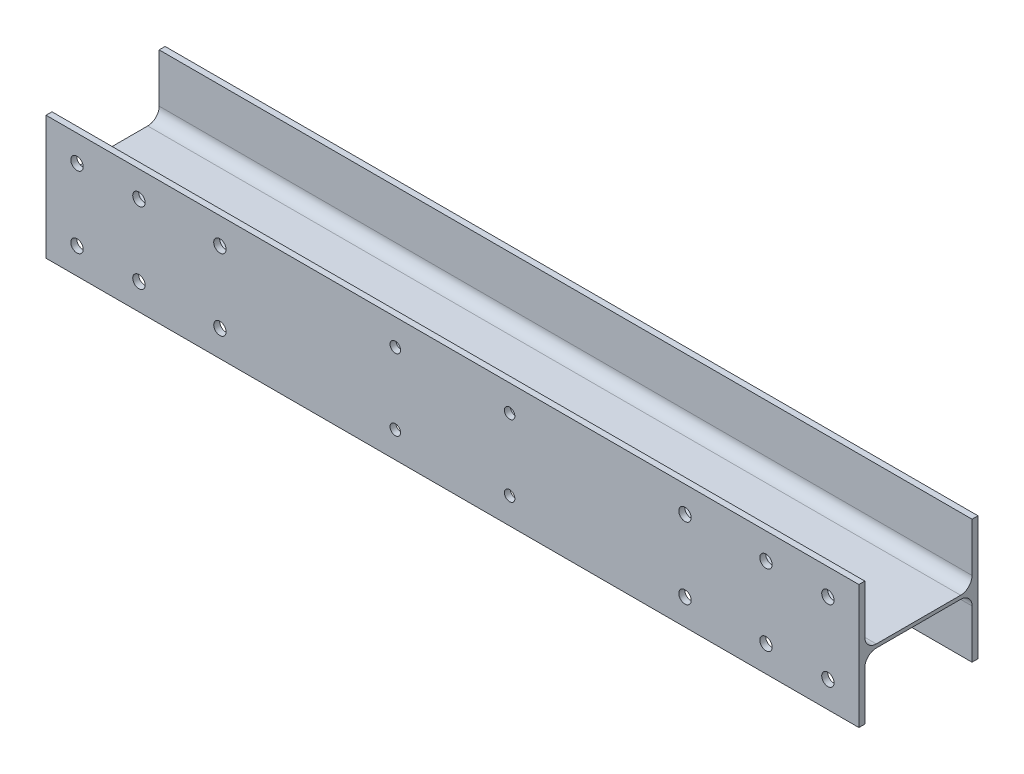
ISO-10303-21;
HEADER;
FILE_DESCRIPTION(('STEP AP214'),'2;1');
FILE_NAME('part.step','',(''),(''),'','','');
FILE_SCHEMA(('AUTOMOTIVE_DESIGN { 1 0 10303 214 1 1 1 1 }'));
ENDSEC;
DATA;
#1=APPLICATION_CONTEXT('core data for automotive mechanical design processes');
#2=APPLICATION_PROTOCOL_DEFINITION('international standard','automotive_design',2000,#1);
#3=PRODUCT_CONTEXT('',#1,'mechanical');
#4=PRODUCT('Part','Part','',(#3));
#5=PRODUCT_RELATED_PRODUCT_CATEGORY('part','',(#4));
#6=PRODUCT_DEFINITION_FORMATION('','',#4);
#7=PRODUCT_DEFINITION_CONTEXT('part definition',#1,'design');
#8=PRODUCT_DEFINITION('design','',#6,#7);
#9=PRODUCT_DEFINITION_SHAPE('','',#8);
#10=(LENGTH_UNIT() NAMED_UNIT(*) SI_UNIT(.MILLI.,.METRE.));
#11=(NAMED_UNIT(*) PLANE_ANGLE_UNIT() SI_UNIT($,.RADIAN.));
#12=(NAMED_UNIT(*) SI_UNIT($,.STERADIAN.) SOLID_ANGLE_UNIT());
#13=UNCERTAINTY_MEASURE_WITH_UNIT(LENGTH_MEASURE(1.E-05),#10,'distance_accuracy_value','');
#14=(GEOMETRIC_REPRESENTATION_CONTEXT(3) GLOBAL_UNCERTAINTY_ASSIGNED_CONTEXT((#13)) GLOBAL_UNIT_ASSIGNED_CONTEXT((#10,
#11,#12)) REPRESENTATION_CONTEXT('',''));
#15=CARTESIAN_POINT('',(0.,0.,0.));
#16=DIRECTION('',(0.,0.,1.));
#17=DIRECTION('',(1.,0.,0.));
#18=AXIS2_PLACEMENT_3D('',#15,#16,#17);
#19=CARTESIAN_POINT('',(-853.,27.7499999999998,88.5));
#20=DIRECTION('',(1.,0.,0.));
#21=DIRECTION('',(0.,1.,0.));
#22=AXIS2_PLACEMENT_3D('',#19,#20,#21);
#23=CYLINDRICAL_SURFACE('',#22,24.);
#24=CARTESIAN_POINT('',(853.,27.7500000000003,88.5));
#25=DIRECTION('',(1.,0.,0.));
#26=DIRECTION('',(0.,-1.,0.));
#27=AXIS2_PLACEMENT_3D('',#24,#25,#26);
#28=CIRCLE('',#27,24.);
#29=CARTESIAN_POINT('',(853.,27.7500000000003,112.5));
#30=VERTEX_POINT('',#29);
#31=CARTESIAN_POINT('',(853.,3.7500000000003,88.5));
#32=VERTEX_POINT('',#31);
#33=EDGE_CURVE('E232',#30,#32,#28,.T.);
#34=ORIENTED_EDGE('',*,*,#33,.T.);
#35=DIRECTION('',(1.,0.,0.));
#36=VECTOR('',#35,1.);
#37=CARTESIAN_POINT('',(-853.,3.74999999999978,88.5));
#38=LINE('',#37,#36);
#39=CARTESIAN_POINT('',(-853.,3.74999999999978,88.5));
#40=VERTEX_POINT('',#39);
#41=EDGE_CURVE('E13',#40,#32,#38,.T.);
#42=ORIENTED_EDGE('',*,*,#41,.F.);
#43=CARTESIAN_POINT('',(-853.,27.7499999999998,88.5));
#44=DIRECTION('',(1.,0.,0.));
#45=DIRECTION('',(0.,-1.,0.));
#46=AXIS2_PLACEMENT_3D('',#43,#44,#45);
#47=CIRCLE('',#46,24.);
#48=CARTESIAN_POINT('',(-853.,27.7499999999998,112.5));
#49=VERTEX_POINT('',#48);
#50=EDGE_CURVE('E263',#49,#40,#47,.T.);
#51=ORIENTED_EDGE('',*,*,#50,.F.);
#52=DIRECTION('',(1.,0.,0.));
#53=VECTOR('',#52,1.);
#54=CARTESIAN_POINT('',(-853.,27.7499999999998,112.5));
#55=LINE('',#54,#53);
#56=EDGE_CURVE('E228',#49,#30,#55,.T.);
#57=ORIENTED_EDGE('',*,*,#56,.T.);
#58=EDGE_LOOP('',(#34,#42,#51,#57));
#59=FACE_BOUND('',#58,.T.);
#60=ADVANCED_FACE('F88',(#59),#23,.F.);
#61=CARTESIAN_POINT('',(-853.,3.7499999999998,-88.5));
#62=DIRECTION('',(0.,-1.,0.));
#63=DIRECTION('',(1.,0.,0.));
#64=AXIS2_PLACEMENT_3D('',#61,#62,#63);
#65=PLANE('',#64);
#66=DIRECTION('',(0.,0.,-1.));
#67=VECTOR('',#66,1.);
#68=CARTESIAN_POINT('',(853.,3.75000000000032,-88.5));
#69=LINE('',#68,#67);
#70=CARTESIAN_POINT('',(853.,3.75000000000032,-88.5));
#71=VERTEX_POINT('',#70);
#72=EDGE_CURVE('E235',#32,#71,#69,.T.);
#73=ORIENTED_EDGE('',*,*,#72,.T.);
#74=DIRECTION('',(1.,0.,0.));
#75=VECTOR('',#74,1.);
#76=CARTESIAN_POINT('',(-853.,3.7499999999998,-88.5));
#77=LINE('',#76,#75);
#78=CARTESIAN_POINT('',(-853.,3.7499999999998,-88.5));
#79=VERTEX_POINT('',#78);
#80=EDGE_CURVE('E96',#79,#71,#77,.T.);
#81=ORIENTED_EDGE('',*,*,#80,.F.);
#82=DIRECTION('',(0.,0.,-1.));
#83=VECTOR('',#82,1.);
#84=CARTESIAN_POINT('',(-853.,3.7499999999998,-88.5));
#85=LINE('',#84,#83);
#86=EDGE_CURVE('E171',#40,#79,#85,.T.);
#87=ORIENTED_EDGE('',*,*,#86,.F.);
#88=ORIENTED_EDGE('',*,*,#41,.T.);
#89=EDGE_LOOP('',(#73,#81,#87,#88));
#90=FACE_BOUND('',#89,.T.);
#91=ADVANCED_FACE('F364',(#90),#65,.F.);
#92=CARTESIAN_POINT('',(-853.,27.7499999999998,-88.5));
#93=DIRECTION('',(1.,0.,0.));
#94=DIRECTION('',(0.,1.,0.));
#95=AXIS2_PLACEMENT_3D('',#92,#93,#94);
#96=CYLINDRICAL_SURFACE('',#95,24.);
#97=CARTESIAN_POINT('',(853.,27.7500000000003,-88.5));
#98=DIRECTION('',(1.,0.,0.));
#99=DIRECTION('',(0.,-1.,0.));
#100=AXIS2_PLACEMENT_3D('',#97,#98,#99);
#101=CIRCLE('',#100,24.);
#102=CARTESIAN_POINT('',(853.,27.7500000000003,-112.5));
#103=VERTEX_POINT('',#102);
#104=EDGE_CURVE('E238',#71,#103,#101,.T.);
#105=ORIENTED_EDGE('',*,*,#104,.T.);
#106=DIRECTION('',(1.,0.,0.));
#107=VECTOR('',#106,1.);
#108=CARTESIAN_POINT('',(-853.,27.7499999999998,-112.5));
#109=LINE('',#108,#107);
#110=CARTESIAN_POINT('',(-853.,27.7499999999998,-112.5));
#111=VERTEX_POINT('',#110);
#112=EDGE_CURVE('E294',#111,#103,#109,.T.);
#113=ORIENTED_EDGE('',*,*,#112,.F.);
#114=CARTESIAN_POINT('',(-853.,27.7499999999998,-88.5));
#115=DIRECTION('',(1.,0.,0.));
#116=DIRECTION('',(0.,-1.,0.));
#117=AXIS2_PLACEMENT_3D('',#114,#115,#116);
#118=CIRCLE('',#117,24.);
#119=EDGE_CURVE('E302',#79,#111,#118,.T.);
#120=ORIENTED_EDGE('',*,*,#119,.F.);
#121=ORIENTED_EDGE('',*,*,#80,.T.);
#122=EDGE_LOOP('',(#105,#113,#120,#121));
#123=FACE_BOUND('',#122,.T.);
#124=ADVANCED_FACE('F300',(#123),#96,.F.);
#125=CARTESIAN_POINT('',(-853.,27.7499999999998,-112.5));
#126=DIRECTION('',(0.,0.,-1.));
#127=DIRECTION('',(-1.,0.,0.));
#128=AXIS2_PLACEMENT_3D('',#125,#126,#127);
#129=PLANE('',#128);
#130=DIRECTION('',(0.,1.,0.));
#131=VECTOR('',#130,1.);
#132=CARTESIAN_POINT('',(853.,27.7500000000003,-112.5));
#133=LINE('',#132,#131);
#134=CARTESIAN_POINT('',(853.,130.,-112.5));
#135=VERTEX_POINT('',#134);
#136=EDGE_CURVE('E240',#103,#135,#133,.T.);
#137=ORIENTED_EDGE('',*,*,#136,.T.);
#138=DIRECTION('',(1.,0.,0.));
#139=VECTOR('',#138,1.);
#140=CARTESIAN_POINT('',(-853.,130.,-112.5));
#141=LINE('',#140,#139);
#142=CARTESIAN_POINT('',(-853.,130.,-112.5));
#143=VERTEX_POINT('',#142);
#144=EDGE_CURVE('E291',#143,#135,#141,.T.);
#145=ORIENTED_EDGE('',*,*,#144,.F.);
#146=DIRECTION('',(0.,1.,0.));
#147=VECTOR('',#146,1.);
#148=CARTESIAN_POINT('',(-853.,27.7499999999998,-112.5));
#149=LINE('',#148,#147);
#150=EDGE_CURVE('E320',#111,#143,#149,.T.);
#151=ORIENTED_EDGE('',*,*,#150,.F.);
#152=ORIENTED_EDGE('',*,*,#112,.T.);
#153=EDGE_LOOP('',(#137,#145,#151,#152));
#154=FACE_BOUND('',#153,.T.);
#155=ADVANCED_FACE('F311',(#154),#129,.F.);
#156=CARTESIAN_POINT('',(-853.,130.,-112.5));
#157=DIRECTION('',(0.,-1.,0.));
#158=DIRECTION('',(1.,0.,0.));
#159=AXIS2_PLACEMENT_3D('',#156,#157,#158);
#160=PLANE('',#159);
#161=DIRECTION('',(0.,0.,-1.));
#162=VECTOR('',#161,1.);
#163=CARTESIAN_POINT('',(853.,130.,-112.5));
#164=LINE('',#163,#162);
#165=CARTESIAN_POINT('',(853.,130.,-125.));
#166=VERTEX_POINT('',#165);
#167=EDGE_CURVE('E242',#135,#166,#164,.T.);
#168=ORIENTED_EDGE('',*,*,#167,.T.);
#169=DIRECTION('',(1.,0.,0.));
#170=VECTOR('',#169,1.);
#171=CARTESIAN_POINT('',(-853.,130.,-125.));
#172=LINE('',#171,#170);
#173=CARTESIAN_POINT('',(-853.,130.,-125.));
#174=VERTEX_POINT('',#173);
#175=EDGE_CURVE('E288',#174,#166,#172,.T.);
#176=ORIENTED_EDGE('',*,*,#175,.F.);
#177=DIRECTION('',(0.,0.,-1.));
#178=VECTOR('',#177,1.);
#179=CARTESIAN_POINT('',(-853.,130.,-112.5));
#180=LINE('',#179,#178);
#181=EDGE_CURVE('E317',#143,#174,#180,.T.);
#182=ORIENTED_EDGE('',*,*,#181,.F.);
#183=ORIENTED_EDGE('',*,*,#144,.T.);
#184=EDGE_LOOP('',(#168,#176,#182,#183));
#185=FACE_BOUND('',#184,.T.);
#186=ADVANCED_FACE('F315',(#185),#160,.F.);
#187=CARTESIAN_POINT('',(-853.,130.,-125.));
#188=DIRECTION('',(0.,0.,1.));
#189=DIRECTION('',(1.,0.,0.));
#190=AXIS2_PLACEMENT_3D('',#187,#188,#189);
#191=PLANE('',#190);
#192=DIRECTION('',(0.,-1.,0.));
#193=VECTOR('',#192,1.);
#194=CARTESIAN_POINT('',(853.,130.,-125.));
#195=LINE('',#194,#193);
#196=CARTESIAN_POINT('',(853.,-130.,-125.));
#197=VERTEX_POINT('',#196);
#198=EDGE_CURVE('E244',#166,#197,#195,.T.);
#199=ORIENTED_EDGE('',*,*,#198,.T.);
#200=DIRECTION('',(1.,0.,0.));
#201=VECTOR('',#200,1.);
#202=CARTESIAN_POINT('',(-853.,-130.,-125.));
#203=LINE('',#202,#201);
#204=CARTESIAN_POINT('',(-853.,-130.,-125.));
#205=VERTEX_POINT('',#204);
#206=EDGE_CURVE('E285',#205,#197,#203,.T.);
#207=ORIENTED_EDGE('',*,*,#206,.F.);
#208=DIRECTION('',(0.,-1.,0.));
#209=VECTOR('',#208,1.);
#210=CARTESIAN_POINT('',(-853.,130.,-125.));
#211=LINE('',#210,#209);
#212=EDGE_CURVE('E319',#174,#205,#211,.T.);
#213=ORIENTED_EDGE('',*,*,#212,.F.);
#214=ORIENTED_EDGE('',*,*,#175,.T.);
#215=EDGE_LOOP('',(#199,#207,#213,#214));
#216=FACE_BOUND('',#215,.T.);
#217=ADVANCED_FACE('F377',(#216),#191,.F.);
#218=CARTESIAN_POINT('',(-853.,-130.,-125.));
#219=DIRECTION('',(0.,1.,0.));
#220=DIRECTION('',(-1.,0.,0.));
#221=AXIS2_PLACEMENT_3D('',#218,#219,#220);
#222=PLANE('',#221);
#223=DIRECTION('',(0.,0.,1.));
#224=VECTOR('',#223,1.);
#225=CARTESIAN_POINT('',(853.,-130.,-125.));
#226=LINE('',#225,#224);
#227=CARTESIAN_POINT('',(853.,-130.,-112.5));
#228=VERTEX_POINT('',#227);
#229=EDGE_CURVE('E246',#197,#228,#226,.T.);
#230=ORIENTED_EDGE('',*,*,#229,.T.);
#231=DIRECTION('',(1.,0.,0.));
#232=VECTOR('',#231,1.);
#233=CARTESIAN_POINT('',(-853.,-130.,-112.5));
#234=LINE('',#233,#232);
#235=CARTESIAN_POINT('',(-853.,-130.,-112.5));
#236=VERTEX_POINT('',#235);
#237=EDGE_CURVE('E282',#236,#228,#234,.T.);
#238=ORIENTED_EDGE('',*,*,#237,.F.);
#239=DIRECTION('',(0.,0.,1.));
#240=VECTOR('',#239,1.);
#241=CARTESIAN_POINT('',(-853.,-130.,-125.));
#242=LINE('',#241,#240);
#243=EDGE_CURVE('E322',#205,#236,#242,.T.);
#244=ORIENTED_EDGE('',*,*,#243,.F.);
#245=ORIENTED_EDGE('',*,*,#206,.T.);
#246=EDGE_LOOP('',(#230,#238,#244,#245));
#247=FACE_BOUND('',#246,.T.);
#248=ADVANCED_FACE('F380',(#247),#222,.F.);
#249=CARTESIAN_POINT('',(-853.,-130.,-112.5));
#250=DIRECTION('',(0.,0.,-1.));
#251=DIRECTION('',(0.,1.,0.));
#252=AXIS2_PLACEMENT_3D('',#249,#250,#251);
#253=PLANE('',#252);
#254=DIRECTION('',(0.,1.,0.));
#255=VECTOR('',#254,1.);
#256=CARTESIAN_POINT('',(853.,-130.,-112.5));
#257=LINE('',#256,#255);
#258=CARTESIAN_POINT('',(853.,-27.7499999999997,-112.5));
#259=VERTEX_POINT('',#258);
#260=EDGE_CURVE('E248',#228,#259,#257,.T.);
#261=ORIENTED_EDGE('',*,*,#260,.T.);
#262=DIRECTION('',(1.,0.,0.));
#263=VECTOR('',#262,1.);
#264=CARTESIAN_POINT('',(-853.,-27.7500000000002,-112.5));
#265=LINE('',#264,#263);
#266=CARTESIAN_POINT('',(-853.,-27.7500000000002,-112.5));
#267=VERTEX_POINT('',#266);
#268=EDGE_CURVE('E279',#267,#259,#265,.T.);
#269=ORIENTED_EDGE('',*,*,#268,.F.);
#270=DIRECTION('',(0.,1.,0.));
#271=VECTOR('',#270,1.);
#272=CARTESIAN_POINT('',(-853.,-130.,-112.5));
#273=LINE('',#272,#271);
#274=EDGE_CURVE('E328',#236,#267,#273,.T.);
#275=ORIENTED_EDGE('',*,*,#274,.F.);
#276=ORIENTED_EDGE('',*,*,#237,.T.);
#277=EDGE_LOOP('',(#261,#269,#275,#276));
#278=FACE_BOUND('',#277,.T.);
#279=ADVANCED_FACE('F384',(#278),#253,.F.);
#280=CARTESIAN_POINT('',(-853.,-27.7500000000002,-88.5));
#281=DIRECTION('',(1.,0.,0.));
#282=DIRECTION('',(0.,1.,0.));
#283=AXIS2_PLACEMENT_3D('',#280,#281,#282);
#284=CYLINDRICAL_SURFACE('',#283,24.);
#285=CARTESIAN_POINT('',(853.,-27.7499999999997,-88.5));
#286=DIRECTION('',(1.,0.,0.));
#287=DIRECTION('',(0.,-1.,0.));
#288=AXIS2_PLACEMENT_3D('',#285,#286,#287);
#289=CIRCLE('',#288,24.);
#290=CARTESIAN_POINT('',(853.,-3.74999999999969,-88.5));
#291=VERTEX_POINT('',#290);
#292=EDGE_CURVE('E250',#259,#291,#289,.T.);
#293=ORIENTED_EDGE('',*,*,#292,.T.);
#294=DIRECTION('',(1.,0.,0.));
#295=VECTOR('',#294,1.);
#296=CARTESIAN_POINT('',(-853.,-3.75000000000021,-88.5));
#297=LINE('',#296,#295);
#298=CARTESIAN_POINT('',(-853.,-3.75000000000021,-88.5));
#299=VERTEX_POINT('',#298);
#300=EDGE_CURVE('E276',#299,#291,#297,.T.);
#301=ORIENTED_EDGE('',*,*,#300,.F.);
#302=CARTESIAN_POINT('',(-853.,-27.7500000000002,-88.5));
#303=DIRECTION('',(1.,0.,0.));
#304=DIRECTION('',(0.,-1.,0.));
#305=AXIS2_PLACEMENT_3D('',#302,#303,#304);
#306=CIRCLE('',#305,24.);
#307=EDGE_CURVE('E330',#267,#299,#306,.T.);
#308=ORIENTED_EDGE('',*,*,#307,.F.);
#309=ORIENTED_EDGE('',*,*,#268,.T.);
#310=EDGE_LOOP('',(#293,#301,#308,#309));
#311=FACE_BOUND('',#310,.T.);
#312=ADVANCED_FACE('F388',(#311),#284,.F.);
#313=CARTESIAN_POINT('',(-853.,-3.75000000000021,-88.5));
#314=DIRECTION('',(0.,1.,0.));
#315=DIRECTION('',(-1.,0.,0.));
#316=AXIS2_PLACEMENT_3D('',#313,#314,#315);
#317=PLANE('',#316);
#318=DIRECTION('',(0.,0.,1.));
#319=VECTOR('',#318,1.);
#320=CARTESIAN_POINT('',(853.,-3.74999999999969,-88.5));
#321=LINE('',#320,#319);
#322=CARTESIAN_POINT('',(853.,-3.74999999999967,88.5));
#323=VERTEX_POINT('',#322);
#324=EDGE_CURVE('E252',#291,#323,#321,.T.);
#325=ORIENTED_EDGE('',*,*,#324,.T.);
#326=DIRECTION('',(1.,0.,0.));
#327=VECTOR('',#326,1.);
#328=CARTESIAN_POINT('',(-853.,-3.75000000000019,88.5));
#329=LINE('',#328,#327);
#330=CARTESIAN_POINT('',(-853.,-3.75000000000019,88.5));
#331=VERTEX_POINT('',#330);
#332=EDGE_CURVE('E273',#331,#323,#329,.T.);
#333=ORIENTED_EDGE('',*,*,#332,.F.);
#334=DIRECTION('',(0.,0.,1.));
#335=VECTOR('',#334,1.);
#336=CARTESIAN_POINT('',(-853.,-3.75000000000021,-88.5));
#337=LINE('',#336,#335);
#338=EDGE_CURVE('E332',#299,#331,#337,.T.);
#339=ORIENTED_EDGE('',*,*,#338,.F.);
#340=ORIENTED_EDGE('',*,*,#300,.T.);
#341=EDGE_LOOP('',(#325,#333,#339,#340));
#342=FACE_BOUND('',#341,.T.);
#343=ADVANCED_FACE('F392',(#342),#317,.F.);
#344=CARTESIAN_POINT('',(-853.,-27.7500000000002,88.5));
#345=DIRECTION('',(1.,0.,0.));
#346=DIRECTION('',(0.,1.,0.));
#347=AXIS2_PLACEMENT_3D('',#344,#345,#346);
#348=CYLINDRICAL_SURFACE('',#347,24.);
#349=CARTESIAN_POINT('',(853.,-27.7499999999997,88.5));
#350=DIRECTION('',(1.,0.,0.));
#351=DIRECTION('',(0.,-1.,0.));
#352=AXIS2_PLACEMENT_3D('',#349,#350,#351);
#353=CIRCLE('',#352,24.);
#354=CARTESIAN_POINT('',(853.,-27.7499999999997,112.5));
#355=VERTEX_POINT('',#354);
#356=EDGE_CURVE('E254',#323,#355,#353,.T.);
#357=ORIENTED_EDGE('',*,*,#356,.T.);
#358=DIRECTION('',(1.,0.,0.));
#359=VECTOR('',#358,1.);
#360=CARTESIAN_POINT('',(-853.,-27.7500000000002,112.5));
#361=LINE('',#360,#359);
#362=CARTESIAN_POINT('',(-853.,-27.7500000000002,112.5));
#363=VERTEX_POINT('',#362);
#364=EDGE_CURVE('E270',#363,#355,#361,.T.);
#365=ORIENTED_EDGE('',*,*,#364,.F.);
#366=CARTESIAN_POINT('',(-853.,-27.7500000000002,88.5));
#367=DIRECTION('',(1.,0.,0.));
#368=DIRECTION('',(0.,-1.,0.));
#369=AXIS2_PLACEMENT_3D('',#366,#367,#368);
#370=CIRCLE('',#369,24.);
#371=EDGE_CURVE('E334',#331,#363,#370,.T.);
#372=ORIENTED_EDGE('',*,*,#371,.F.);
#373=ORIENTED_EDGE('',*,*,#332,.T.);
#374=EDGE_LOOP('',(#357,#365,#372,#373));
#375=FACE_BOUND('',#374,.T.);
#376=ADVANCED_FACE('F396',(#375),#348,.F.);
#377=CARTESIAN_POINT('',(-853.,-27.7500000000002,112.5));
#378=DIRECTION('',(0.,0.,1.));
#379=DIRECTION('',(0.,-1.,0.));
#380=AXIS2_PLACEMENT_3D('',#377,#378,#379);
#381=PLANE('',#380);
#382=CARTESIAN_POINT('',(120.,-75.,112.5));
#383=DIRECTION('',(0.,0.,1.));
#384=DIRECTION('',(0.,-1.,0.));
#385=AXIS2_PLACEMENT_3D('',#382,#383,#384);
#386=CIRCLE('',#385,11.);
#387=CARTESIAN_POINT('',(120.,-86.,112.5));
#388=VERTEX_POINT('',#387);
#389=EDGE_CURVE('E536',#388,#388,#386,.F.);
#390=ORIENTED_EDGE('',*,*,#389,.F.);
#391=EDGE_LOOP('',(#390));
#392=FACE_BOUND('',#391,.T.);
#393=CARTESIAN_POINT('',(-120.,-75.,112.5));
#394=DIRECTION('',(0.,0.,1.));
#395=DIRECTION('',(0.,-1.,0.));
#396=AXIS2_PLACEMENT_3D('',#393,#394,#395);
#397=CIRCLE('',#396,11.);
#398=CARTESIAN_POINT('',(-120.,-86.,112.5));
#399=VERTEX_POINT('',#398);
#400=EDGE_CURVE('E532',#399,#399,#397,.F.);
#401=ORIENTED_EDGE('',*,*,#400,.F.);
#402=EDGE_LOOP('',(#401));
#403=FACE_BOUND('',#402,.T.);
#404=CARTESIAN_POINT('',(788.,-74.9999999999999,112.5));
#405=DIRECTION('',(0.,0.,1.));
#406=DIRECTION('',(0.,-1.,0.));
#407=AXIS2_PLACEMENT_3D('',#404,#405,#406);
#408=CIRCLE('',#407,13.);
#409=CARTESIAN_POINT('',(788.,-87.9999999999999,112.5));
#410=VERTEX_POINT('',#409);
#411=EDGE_CURVE('E516',#410,#410,#408,.F.);
#412=ORIENTED_EDGE('',*,*,#411,.F.);
#413=EDGE_LOOP('',(#412));
#414=FACE_BOUND('',#413,.T.);
#415=CARTESIAN_POINT('',(658.,-74.9999999999999,112.5));
#416=DIRECTION('',(0.,0.,1.));
#417=DIRECTION('',(0.,-1.,0.));
#418=AXIS2_PLACEMENT_3D('',#415,#416,#417);
#419=CIRCLE('',#418,13.);
#420=CARTESIAN_POINT('',(658.,-87.9999999999999,112.5));
#421=VERTEX_POINT('',#420);
#422=EDGE_CURVE('E512',#421,#421,#419,.F.);
#423=ORIENTED_EDGE('',*,*,#422,.F.);
#424=EDGE_LOOP('',(#423));
#425=FACE_BOUND('',#424,.T.);
#426=CARTESIAN_POINT('',(488.,-74.9999999999999,112.5));
#427=DIRECTION('',(0.,0.,1.));
#428=DIRECTION('',(0.,-1.,0.));
#429=AXIS2_PLACEMENT_3D('',#426,#427,#428);
#430=CIRCLE('',#429,13.0000000000001);
#431=CARTESIAN_POINT('',(488.,-88.,112.5));
#432=VERTEX_POINT('',#431);
#433=EDGE_CURVE('E500',#432,#432,#430,.F.);
#434=ORIENTED_EDGE('',*,*,#433,.F.);
#435=EDGE_LOOP('',(#434));
#436=FACE_BOUND('',#435,.T.);
#437=CARTESIAN_POINT('',(-488.,-75.,112.5));
#438=DIRECTION('',(0.,0.,1.));
#439=DIRECTION('',(0.,-1.,0.));
#440=AXIS2_PLACEMENT_3D('',#437,#438,#439);
#441=CIRCLE('',#440,13.);
#442=CARTESIAN_POINT('',(-488.,-88.,112.5));
#443=VERTEX_POINT('',#442);
#444=EDGE_CURVE('E496',#443,#443,#441,.F.);
#445=ORIENTED_EDGE('',*,*,#444,.F.);
#446=EDGE_LOOP('',(#445));
#447=FACE_BOUND('',#446,.T.);
#448=CARTESIAN_POINT('',(-658.,-75.0000000000001,112.5));
#449=DIRECTION('',(0.,0.,1.));
#450=DIRECTION('',(0.,-1.,0.));
#451=AXIS2_PLACEMENT_3D('',#448,#449,#450);
#452=CIRCLE('',#451,13.);
#453=CARTESIAN_POINT('',(-658.,-88.0000000000001,112.5));
#454=VERTEX_POINT('',#453);
#455=EDGE_CURVE('E484',#454,#454,#452,.F.);
#456=ORIENTED_EDGE('',*,*,#455,.F.);
#457=EDGE_LOOP('',(#456));
#458=FACE_BOUND('',#457,.T.);
#459=CARTESIAN_POINT('',(-788.,-75.0000000000001,112.5));
#460=DIRECTION('',(0.,0.,1.));
#461=DIRECTION('',(0.,-1.,0.));
#462=AXIS2_PLACEMENT_3D('',#459,#460,#461);
#463=CIRCLE('',#462,13.);
#464=CARTESIAN_POINT('',(-788.,-88.0000000000001,112.5));
#465=VERTEX_POINT('',#464);
#466=EDGE_CURVE('E474',#465,#465,#463,.F.);
#467=ORIENTED_EDGE('',*,*,#466,.F.);
#468=EDGE_LOOP('',(#467));
#469=FACE_BOUND('',#468,.T.);
#470=DIRECTION('',(0.,-1.,0.));
#471=VECTOR('',#470,1.);
#472=CARTESIAN_POINT('',(853.,-27.7499999999997,112.5));
#473=LINE('',#472,#471);
#474=CARTESIAN_POINT('',(853.,-130.,112.5));
#475=VERTEX_POINT('',#474);
#476=EDGE_CURVE('E256',#355,#475,#473,.T.);
#477=ORIENTED_EDGE('',*,*,#476,.T.);
#478=DIRECTION('',(1.,0.,0.));
#479=VECTOR('',#478,1.);
#480=CARTESIAN_POINT('',(-853.,-130.,112.5));
#481=LINE('',#480,#479);
#482=CARTESIAN_POINT('',(-853.,-130.,112.5));
#483=VERTEX_POINT('',#482);
#484=EDGE_CURVE('E267',#483,#475,#481,.T.);
#485=ORIENTED_EDGE('',*,*,#484,.F.);
#486=DIRECTION('',(0.,-1.,0.));
#487=VECTOR('',#486,1.);
#488=CARTESIAN_POINT('',(-853.,-27.7500000000002,112.5));
#489=LINE('',#488,#487);
#490=EDGE_CURVE('E336',#363,#483,#489,.T.);
#491=ORIENTED_EDGE('',*,*,#490,.F.);
#492=ORIENTED_EDGE('',*,*,#364,.T.);
#493=EDGE_LOOP('',(#477,#485,#491,#492));
#494=FACE_BOUND('',#493,.T.);
#495=ADVANCED_FACE('F342',(#392,#403,#414,#425,#436,#447,#458,#469,#494),#381,.F.);
#496=CARTESIAN_POINT('',(-853.,-130.,112.5));
#497=DIRECTION('',(0.,1.,0.));
#498=DIRECTION('',(-1.,0.,0.));
#499=AXIS2_PLACEMENT_3D('',#496,#497,#498);
#500=PLANE('',#499);
#501=DIRECTION('',(0.,0.,1.));
#502=VECTOR('',#501,1.);
#503=CARTESIAN_POINT('',(853.,-130.,112.5));
#504=LINE('',#503,#502);
#505=CARTESIAN_POINT('',(853.,-130.,125.));
#506=VERTEX_POINT('',#505);
#507=EDGE_CURVE('E258',#475,#506,#504,.T.);
#508=ORIENTED_EDGE('',*,*,#507,.T.);
#509=DIRECTION('',(1.,0.,0.));
#510=VECTOR('',#509,1.);
#511=CARTESIAN_POINT('',(-853.,-130.,125.));
#512=LINE('',#511,#510);
#513=CARTESIAN_POINT('',(-853.,-130.,125.));
#514=VERTEX_POINT('',#513);
#515=EDGE_CURVE('E223',#514,#506,#512,.T.);
#516=ORIENTED_EDGE('',*,*,#515,.F.);
#517=DIRECTION('',(0.,0.,1.));
#518=VECTOR('',#517,1.);
#519=CARTESIAN_POINT('',(-853.,-130.,112.5));
#520=LINE('',#519,#518);
#521=EDGE_CURVE('E214',#483,#514,#520,.T.);
#522=ORIENTED_EDGE('',*,*,#521,.F.);
#523=ORIENTED_EDGE('',*,*,#484,.T.);
#524=EDGE_LOOP('',(#508,#516,#522,#523));
#525=FACE_BOUND('',#524,.T.);
#526=ADVANCED_FACE('F346',(#525),#500,.F.);
#527=CARTESIAN_POINT('',(-853.,-130.,125.));
#528=DIRECTION('',(0.,0.,-1.));
#529=DIRECTION('',(0.,1.,0.));
#530=AXIS2_PLACEMENT_3D('',#527,#528,#529);
#531=PLANE('',#530);
#532=CARTESIAN_POINT('',(120.,-75.,125.));
#533=DIRECTION('',(0.,0.,1.));
#534=DIRECTION('',(1.,0.,0.));
#535=AXIS2_PLACEMENT_3D('',#532,#533,#534);
#536=CIRCLE('',#535,11.);
#537=CARTESIAN_POINT('',(131.,-75.,125.));
#538=VERTEX_POINT('',#537);
#539=EDGE_CURVE('E413',#538,#538,#536,.T.);
#540=ORIENTED_EDGE('',*,*,#539,.F.);
#541=EDGE_LOOP('',(#540));
#542=FACE_BOUND('',#541,.T.);
#543=CARTESIAN_POINT('',(-120.,-75.,125.));
#544=DIRECTION('',(0.,0.,1.));
#545=DIRECTION('',(1.,0.,0.));
#546=AXIS2_PLACEMENT_3D('',#543,#544,#545);
#547=CIRCLE('',#546,11.);
#548=CARTESIAN_POINT('',(-109.,-75.,125.));
#549=VERTEX_POINT('',#548);
#550=EDGE_CURVE('E417',#549,#549,#547,.T.);
#551=ORIENTED_EDGE('',*,*,#550,.F.);
#552=EDGE_LOOP('',(#551));
#553=FACE_BOUND('',#552,.T.);
#554=CARTESIAN_POINT('',(120.,75.,125.));
#555=DIRECTION('',(0.,0.,1.));
#556=DIRECTION('',(1.,0.,0.));
#557=AXIS2_PLACEMENT_3D('',#554,#555,#556);
#558=CIRCLE('',#557,11.);
#559=CARTESIAN_POINT('',(131.,75.,125.));
#560=VERTEX_POINT('',#559);
#561=EDGE_CURVE('E421',#560,#560,#558,.T.);
#562=ORIENTED_EDGE('',*,*,#561,.F.);
#563=EDGE_LOOP('',(#562));
#564=FACE_BOUND('',#563,.T.);
#565=CARTESIAN_POINT('',(-120.,75.,125.));
#566=DIRECTION('',(0.,0.,1.));
#567=DIRECTION('',(1.,0.,0.));
#568=AXIS2_PLACEMENT_3D('',#565,#566,#567);
#569=CIRCLE('',#568,11.);
#570=CARTESIAN_POINT('',(-109.,75.,125.));
#571=VERTEX_POINT('',#570);
#572=EDGE_CURVE('E425',#571,#571,#569,.T.);
#573=ORIENTED_EDGE('',*,*,#572,.F.);
#574=EDGE_LOOP('',(#573));
#575=FACE_BOUND('',#574,.T.);
#576=CARTESIAN_POINT('',(788.,75.0000000000001,125.));
#577=DIRECTION('',(0.,0.,1.));
#578=DIRECTION('',(-1.,0.,0.));
#579=AXIS2_PLACEMENT_3D('',#576,#577,#578);
#580=CIRCLE('',#579,13.);
#581=CARTESIAN_POINT('',(775.,75.0000000000001,125.));
#582=VERTEX_POINT('',#581);
#583=EDGE_CURVE('E429',#582,#582,#580,.T.);
#584=ORIENTED_EDGE('',*,*,#583,.F.);
#585=EDGE_LOOP('',(#584));
#586=FACE_BOUND('',#585,.T.);
#587=CARTESIAN_POINT('',(788.,-74.9999999999999,125.));
#588=DIRECTION('',(0.,0.,1.));
#589=DIRECTION('',(-1.,0.,0.));
#590=AXIS2_PLACEMENT_3D('',#587,#588,#589);
#591=CIRCLE('',#590,13.);
#592=CARTESIAN_POINT('',(775.,-74.9999999999999,125.));
#593=VERTEX_POINT('',#592);
#594=EDGE_CURVE('E433',#593,#593,#591,.T.);
#595=ORIENTED_EDGE('',*,*,#594,.F.);
#596=EDGE_LOOP('',(#595));
#597=FACE_BOUND('',#596,.T.);
#598=CARTESIAN_POINT('',(658.,-74.9999999999999,125.));
#599=DIRECTION('',(0.,0.,1.));
#600=DIRECTION('',(-1.,0.,0.));
#601=AXIS2_PLACEMENT_3D('',#598,#599,#600);
#602=CIRCLE('',#601,13.);
#603=CARTESIAN_POINT('',(645.,-74.9999999999999,125.));
#604=VERTEX_POINT('',#603);
#605=EDGE_CURVE('E437',#604,#604,#602,.T.);
#606=ORIENTED_EDGE('',*,*,#605,.F.);
#607=EDGE_LOOP('',(#606));
#608=FACE_BOUND('',#607,.T.);
#609=CARTESIAN_POINT('',(658.,75.0000000000001,125.));
#610=DIRECTION('',(0.,0.,1.));
#611=DIRECTION('',(-1.,0.,0.));
#612=AXIS2_PLACEMENT_3D('',#609,#610,#611);
#613=CIRCLE('',#612,13.);
#614=CARTESIAN_POINT('',(645.,75.0000000000001,125.));
#615=VERTEX_POINT('',#614);
#616=EDGE_CURVE('E441',#615,#615,#613,.T.);
#617=ORIENTED_EDGE('',*,*,#616,.F.);
#618=EDGE_LOOP('',(#617));
#619=FACE_BOUND('',#618,.T.);
#620=CARTESIAN_POINT('',(488.,75.0000000000001,125.));
#621=DIRECTION('',(0.,0.,1.));
#622=DIRECTION('',(-1.,0.,0.));
#623=AXIS2_PLACEMENT_3D('',#620,#621,#622);
#624=CIRCLE('',#623,13.0000000000001);
#625=CARTESIAN_POINT('',(475.,75.0000000000001,125.));
#626=VERTEX_POINT('',#625);
#627=EDGE_CURVE('E445',#626,#626,#624,.T.);
#628=ORIENTED_EDGE('',*,*,#627,.F.);
#629=EDGE_LOOP('',(#628));
#630=FACE_BOUND('',#629,.T.);
#631=CARTESIAN_POINT('',(488.,-74.9999999999999,125.));
#632=DIRECTION('',(0.,0.,1.));
#633=DIRECTION('',(-1.,0.,0.));
#634=AXIS2_PLACEMENT_3D('',#631,#632,#633);
#635=CIRCLE('',#634,13.0000000000001);
#636=CARTESIAN_POINT('',(475.,-74.9999999999999,125.));
#637=VERTEX_POINT('',#636);
#638=EDGE_CURVE('E449',#637,#637,#635,.T.);
#639=ORIENTED_EDGE('',*,*,#638,.F.);
#640=EDGE_LOOP('',(#639));
#641=FACE_BOUND('',#640,.T.);
#642=CARTESIAN_POINT('',(-488.,-75.,125.));
#643=DIRECTION('',(0.,0.,1.));
#644=DIRECTION('',(1.,0.,0.));
#645=AXIS2_PLACEMENT_3D('',#642,#643,#644);
#646=CIRCLE('',#645,13.);
#647=CARTESIAN_POINT('',(-475.,-75.,125.));
#648=VERTEX_POINT('',#647);
#649=EDGE_CURVE('E453',#648,#648,#646,.T.);
#650=ORIENTED_EDGE('',*,*,#649,.F.);
#651=EDGE_LOOP('',(#650));
#652=FACE_BOUND('',#651,.T.);
#653=CARTESIAN_POINT('',(-488.,74.9999999999999,125.));
#654=DIRECTION('',(0.,0.,1.));
#655=DIRECTION('',(1.,0.,0.));
#656=AXIS2_PLACEMENT_3D('',#653,#654,#655);
#657=CIRCLE('',#656,13.);
#658=CARTESIAN_POINT('',(-475.,74.9999999999999,125.));
#659=VERTEX_POINT('',#658);
#660=EDGE_CURVE('E457',#659,#659,#657,.T.);
#661=ORIENTED_EDGE('',*,*,#660,.F.);
#662=EDGE_LOOP('',(#661));
#663=FACE_BOUND('',#662,.T.);
#664=CARTESIAN_POINT('',(-658.,74.9999999999999,125.));
#665=DIRECTION('',(0.,0.,1.));
#666=DIRECTION('',(1.,0.,0.));
#667=AXIS2_PLACEMENT_3D('',#664,#665,#666);
#668=CIRCLE('',#667,13.);
#669=CARTESIAN_POINT('',(-645.,74.9999999999999,125.));
#670=VERTEX_POINT('',#669);
#671=EDGE_CURVE('E461',#670,#670,#668,.T.);
#672=ORIENTED_EDGE('',*,*,#671,.F.);
#673=EDGE_LOOP('',(#672));
#674=FACE_BOUND('',#673,.T.);
#675=CARTESIAN_POINT('',(-658.,-75.0000000000001,125.));
#676=DIRECTION('',(0.,0.,1.));
#677=DIRECTION('',(1.,0.,0.));
#678=AXIS2_PLACEMENT_3D('',#675,#676,#677);
#679=CIRCLE('',#678,13.);
#680=CARTESIAN_POINT('',(-645.,-75.0000000000001,125.));
#681=VERTEX_POINT('',#680);
#682=EDGE_CURVE('E465',#681,#681,#679,.T.);
#683=ORIENTED_EDGE('',*,*,#682,.F.);
#684=EDGE_LOOP('',(#683));
#685=FACE_BOUND('',#684,.T.);
#686=CARTESIAN_POINT('',(-788.,-75.0000000000001,125.));
#687=DIRECTION('',(0.,0.,1.));
#688=DIRECTION('',(1.,0.,0.));
#689=AXIS2_PLACEMENT_3D('',#686,#687,#688);
#690=CIRCLE('',#689,13.);
#691=CARTESIAN_POINT('',(-775.,-75.0000000000001,125.));
#692=VERTEX_POINT('',#691);
#693=EDGE_CURVE('E469',#692,#692,#690,.T.);
#694=ORIENTED_EDGE('',*,*,#693,.F.);
#695=EDGE_LOOP('',(#694));
#696=FACE_BOUND('',#695,.T.);
#697=CARTESIAN_POINT('',(-788.,74.9999999999999,125.));
#698=DIRECTION('',(0.,0.,1.));
#699=DIRECTION('',(1.,0.,0.));
#700=AXIS2_PLACEMENT_3D('',#697,#698,#699);
#701=CIRCLE('',#700,13.);
#702=CARTESIAN_POINT('',(-775.,74.9999999999999,125.));
#703=VERTEX_POINT('',#702);
#704=EDGE_CURVE('E472',#703,#703,#701,.T.);
#705=ORIENTED_EDGE('',*,*,#704,.F.);
#706=EDGE_LOOP('',(#705));
#707=FACE_BOUND('',#706,.T.);
#708=DIRECTION('',(0.,1.,0.));
#709=VECTOR('',#708,1.);
#710=CARTESIAN_POINT('',(853.,-130.,125.));
#711=LINE('',#710,#709);
#712=CARTESIAN_POINT('',(853.,130.,125.));
#713=VERTEX_POINT('',#712);
#714=EDGE_CURVE('E222',#506,#713,#711,.T.);
#715=ORIENTED_EDGE('',*,*,#714,.T.);
#716=DIRECTION('',(1.,0.,0.));
#717=VECTOR('',#716,1.);
#718=CARTESIAN_POINT('',(-853.,130.,125.));
#719=LINE('',#718,#717);
#720=CARTESIAN_POINT('',(-853.,130.,125.));
#721=VERTEX_POINT('',#720);
#722=EDGE_CURVE('E219',#721,#713,#719,.T.);
#723=ORIENTED_EDGE('',*,*,#722,.F.);
#724=DIRECTION('',(0.,1.,0.));
#725=VECTOR('',#724,1.);
#726=CARTESIAN_POINT('',(-853.,-130.,125.));
#727=LINE('',#726,#725);
#728=EDGE_CURVE('E208',#514,#721,#727,.T.);
#729=ORIENTED_EDGE('',*,*,#728,.F.);
#730=ORIENTED_EDGE('',*,*,#515,.T.);
#731=EDGE_LOOP('',(#715,#723,#729,#730));
#732=FACE_BOUND('',#731,.T.);
#733=ADVANCED_FACE('F220',(#542,#553,#564,#575,#586,#597,#608,#619,#630,#641,#652,#663,#674,
#685,#696,#707,#732),#531,.F.);
#734=CARTESIAN_POINT('',(-853.,130.,125.));
#735=DIRECTION('',(0.,-1.,0.));
#736=DIRECTION('',(1.,0.,0.));
#737=AXIS2_PLACEMENT_3D('',#734,#735,#736);
#738=PLANE('',#737);
#739=DIRECTION('',(0.,0.,-1.));
#740=VECTOR('',#739,1.);
#741=CARTESIAN_POINT('',(853.,130.,125.));
#742=LINE('',#741,#740);
#743=CARTESIAN_POINT('',(853.,130.,112.5));
#744=VERTEX_POINT('',#743);
#745=EDGE_CURVE('E157',#713,#744,#742,.T.);
#746=ORIENTED_EDGE('',*,*,#745,.T.);
#747=DIRECTION('',(1.,0.,0.));
#748=VECTOR('',#747,1.);
#749=CARTESIAN_POINT('',(-853.,130.,112.5));
#750=LINE('',#749,#748);
#751=CARTESIAN_POINT('',(-853.,130.,112.5));
#752=VERTEX_POINT('',#751);
#753=EDGE_CURVE('E224',#752,#744,#750,.T.);
#754=ORIENTED_EDGE('',*,*,#753,.F.);
#755=DIRECTION('',(0.,0.,-1.));
#756=VECTOR('',#755,1.);
#757=CARTESIAN_POINT('',(-853.,130.,125.));
#758=LINE('',#757,#756);
#759=EDGE_CURVE('E212',#721,#752,#758,.T.);
#760=ORIENTED_EDGE('',*,*,#759,.F.);
#761=ORIENTED_EDGE('',*,*,#722,.T.);
#762=EDGE_LOOP('',(#746,#754,#760,#761));
#763=FACE_BOUND('',#762,.T.);
#764=ADVANCED_FACE('F226',(#763),#738,.F.);
#765=CARTESIAN_POINT('',(-853.,130.,112.5));
#766=DIRECTION('',(0.,0.,1.));
#767=DIRECTION('',(0.,-1.,0.));
#768=AXIS2_PLACEMENT_3D('',#765,#766,#767);
#769=PLANE('',#768);
#770=CARTESIAN_POINT('',(120.,75.,112.5));
#771=DIRECTION('',(0.,0.,1.));
#772=DIRECTION('',(0.,-1.,0.));
#773=AXIS2_PLACEMENT_3D('',#770,#771,#772);
#774=CIRCLE('',#773,11.);
#775=CARTESIAN_POINT('',(120.,64.,112.5));
#776=VERTEX_POINT('',#775);
#777=EDGE_CURVE('E528',#776,#776,#774,.F.);
#778=ORIENTED_EDGE('',*,*,#777,.F.);
#779=EDGE_LOOP('',(#778));
#780=FACE_BOUND('',#779,.T.);
#781=CARTESIAN_POINT('',(-120.,75.,112.5));
#782=DIRECTION('',(0.,0.,1.));
#783=DIRECTION('',(0.,-1.,0.));
#784=AXIS2_PLACEMENT_3D('',#781,#782,#783);
#785=CIRCLE('',#784,11.);
#786=CARTESIAN_POINT('',(-120.,64.,112.5));
#787=VERTEX_POINT('',#786);
#788=EDGE_CURVE('E524',#787,#787,#785,.F.);
#789=ORIENTED_EDGE('',*,*,#788,.F.);
#790=EDGE_LOOP('',(#789));
#791=FACE_BOUND('',#790,.T.);
#792=CARTESIAN_POINT('',(788.,75.0000000000001,112.5));
#793=DIRECTION('',(0.,0.,1.));
#794=DIRECTION('',(0.,-1.,0.));
#795=AXIS2_PLACEMENT_3D('',#792,#793,#794);
#796=CIRCLE('',#795,13.);
#797=CARTESIAN_POINT('',(788.,62.0000000000001,112.5));
#798=VERTEX_POINT('',#797);
#799=EDGE_CURVE('E520',#798,#798,#796,.F.);
#800=ORIENTED_EDGE('',*,*,#799,.F.);
#801=EDGE_LOOP('',(#800));
#802=FACE_BOUND('',#801,.T.);
#803=CARTESIAN_POINT('',(658.,75.0000000000001,112.5));
#804=DIRECTION('',(0.,0.,1.));
#805=DIRECTION('',(0.,-1.,0.));
#806=AXIS2_PLACEMENT_3D('',#803,#804,#805);
#807=CIRCLE('',#806,13.);
#808=CARTESIAN_POINT('',(658.,62.0000000000001,112.5));
#809=VERTEX_POINT('',#808);
#810=EDGE_CURVE('E508',#809,#809,#807,.F.);
#811=ORIENTED_EDGE('',*,*,#810,.F.);
#812=EDGE_LOOP('',(#811));
#813=FACE_BOUND('',#812,.T.);
#814=CARTESIAN_POINT('',(488.,75.0000000000001,112.5));
#815=DIRECTION('',(0.,0.,1.));
#816=DIRECTION('',(0.,-1.,0.));
#817=AXIS2_PLACEMENT_3D('',#814,#815,#816);
#818=CIRCLE('',#817,13.0000000000001);
#819=CARTESIAN_POINT('',(488.,62.,112.5));
#820=VERTEX_POINT('',#819);
#821=EDGE_CURVE('E504',#820,#820,#818,.F.);
#822=ORIENTED_EDGE('',*,*,#821,.F.);
#823=EDGE_LOOP('',(#822));
#824=FACE_BOUND('',#823,.T.);
#825=CARTESIAN_POINT('',(-488.,74.9999999999999,112.5));
#826=DIRECTION('',(0.,0.,1.));
#827=DIRECTION('',(0.,-1.,0.));
#828=AXIS2_PLACEMENT_3D('',#825,#826,#827);
#829=CIRCLE('',#828,13.);
#830=CARTESIAN_POINT('',(-488.,61.9999999999999,112.5));
#831=VERTEX_POINT('',#830);
#832=EDGE_CURVE('E492',#831,#831,#829,.F.);
#833=ORIENTED_EDGE('',*,*,#832,.F.);
#834=EDGE_LOOP('',(#833));
#835=FACE_BOUND('',#834,.T.);
#836=CARTESIAN_POINT('',(-658.,74.9999999999999,112.5));
#837=DIRECTION('',(0.,0.,1.));
#838=DIRECTION('',(0.,-1.,0.));
#839=AXIS2_PLACEMENT_3D('',#836,#837,#838);
#840=CIRCLE('',#839,13.);
#841=CARTESIAN_POINT('',(-658.,61.9999999999999,112.5));
#842=VERTEX_POINT('',#841);
#843=EDGE_CURVE('E488',#842,#842,#840,.F.);
#844=ORIENTED_EDGE('',*,*,#843,.F.);
#845=EDGE_LOOP('',(#844));
#846=FACE_BOUND('',#845,.T.);
#847=CARTESIAN_POINT('',(-788.,74.9999999999999,112.5));
#848=DIRECTION('',(0.,0.,1.));
#849=DIRECTION('',(0.,-1.,0.));
#850=AXIS2_PLACEMENT_3D('',#847,#848,#849);
#851=CIRCLE('',#850,13.);
#852=CARTESIAN_POINT('',(-788.,61.9999999999999,112.5));
#853=VERTEX_POINT('',#852);
#854=EDGE_CURVE('E236',#853,#853,#851,.F.);
#855=ORIENTED_EDGE('',*,*,#854,.F.);
#856=EDGE_LOOP('',(#855));
#857=FACE_BOUND('',#856,.T.);
#858=DIRECTION('',(0.,-1.,0.));
#859=VECTOR('',#858,1.);
#860=CARTESIAN_POINT('',(853.,130.,112.5));
#861=LINE('',#860,#859);
#862=EDGE_CURVE('E163',#744,#30,#861,.T.);
#863=ORIENTED_EDGE('',*,*,#862,.T.);
#864=ORIENTED_EDGE('',*,*,#56,.F.);
#865=DIRECTION('',(0.,-1.,0.));
#866=VECTOR('',#865,1.);
#867=CARTESIAN_POINT('',(-853.,130.,112.5));
#868=LINE('',#867,#866);
#869=EDGE_CURVE('E104',#752,#49,#868,.T.);
#870=ORIENTED_EDGE('',*,*,#869,.F.);
#871=ORIENTED_EDGE('',*,*,#753,.T.);
#872=EDGE_LOOP('',(#863,#864,#870,#871));
#873=FACE_BOUND('',#872,.T.);
#874=ADVANCED_FACE('F350',(#780,#791,#802,#813,#824,#835,#846,#857,#873),#769,.F.);
#875=CARTESIAN_POINT('',(-853.,27.7499999999998,88.5));
#876=DIRECTION('',(-1.,0.,0.));
#877=DIRECTION('',(0.,-1.,0.));
#878=AXIS2_PLACEMENT_3D('',#875,#876,#877);
#879=PLANE('',#878);
#880=ORIENTED_EDGE('',*,*,#50,.T.);
#881=ORIENTED_EDGE('',*,*,#86,.T.);
#882=ORIENTED_EDGE('',*,*,#119,.T.);
#883=ORIENTED_EDGE('',*,*,#150,.T.);
#884=ORIENTED_EDGE('',*,*,#181,.T.);
#885=ORIENTED_EDGE('',*,*,#212,.T.);
#886=ORIENTED_EDGE('',*,*,#243,.T.);
#887=ORIENTED_EDGE('',*,*,#274,.T.);
#888=ORIENTED_EDGE('',*,*,#307,.T.);
#889=ORIENTED_EDGE('',*,*,#338,.T.);
#890=ORIENTED_EDGE('',*,*,#371,.T.);
#891=ORIENTED_EDGE('',*,*,#490,.T.);
#892=ORIENTED_EDGE('',*,*,#521,.T.);
#893=ORIENTED_EDGE('',*,*,#728,.T.);
#894=ORIENTED_EDGE('',*,*,#759,.T.);
#895=ORIENTED_EDGE('',*,*,#869,.T.);
#896=EDGE_LOOP('',(#880,#881,#882,#883,#884,#885,#886,#887,#888,#889,#890,#891,#892,#893,#894,#895));
#897=FACE_BOUND('',#896,.T.);
#898=ADVANCED_FACE('F210',(#897),#879,.T.);
#899=CARTESIAN_POINT('',(853.,27.7500000000003,88.5));
#900=DIRECTION('',(-1.,0.,0.));
#901=DIRECTION('',(0.,-1.,0.));
#902=AXIS2_PLACEMENT_3D('',#899,#900,#901);
#903=PLANE('',#902);
#904=ORIENTED_EDGE('',*,*,#33,.F.);
#905=ORIENTED_EDGE('',*,*,#862,.F.);
#906=ORIENTED_EDGE('',*,*,#745,.F.);
#907=ORIENTED_EDGE('',*,*,#714,.F.);
#908=ORIENTED_EDGE('',*,*,#507,.F.);
#909=ORIENTED_EDGE('',*,*,#476,.F.);
#910=ORIENTED_EDGE('',*,*,#356,.F.);
#911=ORIENTED_EDGE('',*,*,#324,.F.);
#912=ORIENTED_EDGE('',*,*,#292,.F.);
#913=ORIENTED_EDGE('',*,*,#260,.F.);
#914=ORIENTED_EDGE('',*,*,#229,.F.);
#915=ORIENTED_EDGE('',*,*,#198,.F.);
#916=ORIENTED_EDGE('',*,*,#167,.F.);
#917=ORIENTED_EDGE('',*,*,#136,.F.);
#918=ORIENTED_EDGE('',*,*,#104,.F.);
#919=ORIENTED_EDGE('',*,*,#72,.F.);
#920=EDGE_LOOP('',(#904,#905,#906,#907,#908,#909,#910,#911,#912,#913,#914,#915,#916,#917,#918,#919));
#921=FACE_BOUND('',#920,.T.);
#922=ADVANCED_FACE('F306',(#921),#903,.F.);
#923=CARTESIAN_POINT('',(-788.,74.9999999999999,75.7304473782993));
#924=DIRECTION('',(0.,0.,1.));
#925=DIRECTION('',(1.,0.,0.));
#926=AXIS2_PLACEMENT_3D('',#923,#924,#925);
#927=CYLINDRICAL_SURFACE('',#926,13.);
#928=ORIENTED_EDGE('',*,*,#854,.T.);
#929=EDGE_LOOP('',(#928));
#930=FACE_BOUND('',#929,.T.);
#931=ORIENTED_EDGE('',*,*,#704,.T.);
#932=EDGE_LOOP('',(#931));
#933=FACE_BOUND('',#932,.T.);
#934=ADVANCED_FACE('F602',(#930,#933),#927,.F.);
#935=CARTESIAN_POINT('',(-788.,-75.0000000000001,75.7304473782993));
#936=DIRECTION('',(0.,0.,1.));
#937=DIRECTION('',(1.,0.,0.));
#938=AXIS2_PLACEMENT_3D('',#935,#936,#937);
#939=CYLINDRICAL_SURFACE('',#938,13.);
#940=ORIENTED_EDGE('',*,*,#466,.T.);
#941=EDGE_LOOP('',(#940));
#942=FACE_BOUND('',#941,.T.);
#943=ORIENTED_EDGE('',*,*,#693,.T.);
#944=EDGE_LOOP('',(#943));
#945=FACE_BOUND('',#944,.T.);
#946=ADVANCED_FACE('F598',(#942,#945),#939,.F.);
#947=CARTESIAN_POINT('',(-658.,-75.0000000000001,75.7304473782993));
#948=DIRECTION('',(0.,0.,1.));
#949=DIRECTION('',(1.,0.,0.));
#950=AXIS2_PLACEMENT_3D('',#947,#948,#949);
#951=CYLINDRICAL_SURFACE('',#950,13.);
#952=ORIENTED_EDGE('',*,*,#455,.T.);
#953=EDGE_LOOP('',(#952));
#954=FACE_BOUND('',#953,.T.);
#955=ORIENTED_EDGE('',*,*,#682,.T.);
#956=EDGE_LOOP('',(#955));
#957=FACE_BOUND('',#956,.T.);
#958=ADVANCED_FACE('F594',(#954,#957),#951,.F.);
#959=CARTESIAN_POINT('',(-658.,74.9999999999999,75.7304473782993));
#960=DIRECTION('',(0.,0.,1.));
#961=DIRECTION('',(1.,0.,0.));
#962=AXIS2_PLACEMENT_3D('',#959,#960,#961);
#963=CYLINDRICAL_SURFACE('',#962,13.);
#964=ORIENTED_EDGE('',*,*,#843,.T.);
#965=EDGE_LOOP('',(#964));
#966=FACE_BOUND('',#965,.T.);
#967=ORIENTED_EDGE('',*,*,#671,.T.);
#968=EDGE_LOOP('',(#967));
#969=FACE_BOUND('',#968,.T.);
#970=ADVANCED_FACE('F590',(#966,#969),#963,.F.);
#971=CARTESIAN_POINT('',(-488.,74.9999999999999,75.7304473782993));
#972=DIRECTION('',(0.,0.,1.));
#973=DIRECTION('',(1.,0.,0.));
#974=AXIS2_PLACEMENT_3D('',#971,#972,#973);
#975=CYLINDRICAL_SURFACE('',#974,13.);
#976=ORIENTED_EDGE('',*,*,#832,.T.);
#977=EDGE_LOOP('',(#976));
#978=FACE_BOUND('',#977,.T.);
#979=ORIENTED_EDGE('',*,*,#660,.T.);
#980=EDGE_LOOP('',(#979));
#981=FACE_BOUND('',#980,.T.);
#982=ADVANCED_FACE('F586',(#978,#981),#975,.F.);
#983=CARTESIAN_POINT('',(-488.,-75.,75.7304473782993));
#984=DIRECTION('',(0.,0.,1.));
#985=DIRECTION('',(1.,0.,0.));
#986=AXIS2_PLACEMENT_3D('',#983,#984,#985);
#987=CYLINDRICAL_SURFACE('',#986,13.);
#988=ORIENTED_EDGE('',*,*,#444,.T.);
#989=EDGE_LOOP('',(#988));
#990=FACE_BOUND('',#989,.T.);
#991=ORIENTED_EDGE('',*,*,#649,.T.);
#992=EDGE_LOOP('',(#991));
#993=FACE_BOUND('',#992,.T.);
#994=ADVANCED_FACE('F582',(#990,#993),#987,.F.);
#995=CARTESIAN_POINT('',(488.,-74.9999999999999,75.7304473782993));
#996=DIRECTION('',(0.,0.,1.));
#997=DIRECTION('',(1.,0.,0.));
#998=AXIS2_PLACEMENT_3D('',#995,#996,#997);
#999=CYLINDRICAL_SURFACE('',#998,13.0000000000001);
#1000=ORIENTED_EDGE('',*,*,#433,.T.);
#1001=EDGE_LOOP('',(#1000));
#1002=FACE_BOUND('',#1001,.T.);
#1003=ORIENTED_EDGE('',*,*,#638,.T.);
#1004=EDGE_LOOP('',(#1003));
#1005=FACE_BOUND('',#1004,.T.);
#1006=ADVANCED_FACE('F578',(#1002,#1005),#999,.F.);
#1007=CARTESIAN_POINT('',(488.,75.0000000000001,75.7304473782993));
#1008=DIRECTION('',(0.,0.,1.));
#1009=DIRECTION('',(1.,0.,0.));
#1010=AXIS2_PLACEMENT_3D('',#1007,#1008,#1009);
#1011=CYLINDRICAL_SURFACE('',#1010,13.0000000000001);
#1012=ORIENTED_EDGE('',*,*,#821,.T.);
#1013=EDGE_LOOP('',(#1012));
#1014=FACE_BOUND('',#1013,.T.);
#1015=ORIENTED_EDGE('',*,*,#627,.T.);
#1016=EDGE_LOOP('',(#1015));
#1017=FACE_BOUND('',#1016,.T.);
#1018=ADVANCED_FACE('F574',(#1014,#1017),#1011,.F.);
#1019=CARTESIAN_POINT('',(658.,75.0000000000001,75.7304473782993));
#1020=DIRECTION('',(0.,0.,1.));
#1021=DIRECTION('',(1.,0.,0.));
#1022=AXIS2_PLACEMENT_3D('',#1019,#1020,#1021);
#1023=CYLINDRICAL_SURFACE('',#1022,13.);
#1024=ORIENTED_EDGE('',*,*,#810,.T.);
#1025=EDGE_LOOP('',(#1024));
#1026=FACE_BOUND('',#1025,.T.);
#1027=ORIENTED_EDGE('',*,*,#616,.T.);
#1028=EDGE_LOOP('',(#1027));
#1029=FACE_BOUND('',#1028,.T.);
#1030=ADVANCED_FACE('F570',(#1026,#1029),#1023,.F.);
#1031=CARTESIAN_POINT('',(658.,-74.9999999999999,75.7304473782993));
#1032=DIRECTION('',(0.,0.,1.));
#1033=DIRECTION('',(1.,0.,0.));
#1034=AXIS2_PLACEMENT_3D('',#1031,#1032,#1033);
#1035=CYLINDRICAL_SURFACE('',#1034,13.);
#1036=ORIENTED_EDGE('',*,*,#422,.T.);
#1037=EDGE_LOOP('',(#1036));
#1038=FACE_BOUND('',#1037,.T.);
#1039=ORIENTED_EDGE('',*,*,#605,.T.);
#1040=EDGE_LOOP('',(#1039));
#1041=FACE_BOUND('',#1040,.T.);
#1042=ADVANCED_FACE('F566',(#1038,#1041),#1035,.F.);
#1043=CARTESIAN_POINT('',(788.,-74.9999999999999,75.7304473782993));
#1044=DIRECTION('',(0.,0.,1.));
#1045=DIRECTION('',(1.,0.,0.));
#1046=AXIS2_PLACEMENT_3D('',#1043,#1044,#1045);
#1047=CYLINDRICAL_SURFACE('',#1046,13.);
#1048=ORIENTED_EDGE('',*,*,#411,.T.);
#1049=EDGE_LOOP('',(#1048));
#1050=FACE_BOUND('',#1049,.T.);
#1051=ORIENTED_EDGE('',*,*,#594,.T.);
#1052=EDGE_LOOP('',(#1051));
#1053=FACE_BOUND('',#1052,.T.);
#1054=ADVANCED_FACE('F562',(#1050,#1053),#1047,.F.);
#1055=CARTESIAN_POINT('',(788.,75.0000000000001,75.7304473782993));
#1056=DIRECTION('',(0.,0.,1.));
#1057=DIRECTION('',(1.,0.,0.));
#1058=AXIS2_PLACEMENT_3D('',#1055,#1056,#1057);
#1059=CYLINDRICAL_SURFACE('',#1058,13.);
#1060=ORIENTED_EDGE('',*,*,#799,.T.);
#1061=EDGE_LOOP('',(#1060));
#1062=FACE_BOUND('',#1061,.T.);
#1063=ORIENTED_EDGE('',*,*,#583,.T.);
#1064=EDGE_LOOP('',(#1063));
#1065=FACE_BOUND('',#1064,.T.);
#1066=ADVANCED_FACE('F558',(#1062,#1065),#1059,.F.);
#1067=CARTESIAN_POINT('',(-120.,75.,75.7304473782993));
#1068=DIRECTION('',(0.,0.,1.));
#1069=DIRECTION('',(1.,0.,0.));
#1070=AXIS2_PLACEMENT_3D('',#1067,#1068,#1069);
#1071=CYLINDRICAL_SURFACE('',#1070,11.);
#1072=ORIENTED_EDGE('',*,*,#788,.T.);
#1073=EDGE_LOOP('',(#1072));
#1074=FACE_BOUND('',#1073,.T.);
#1075=ORIENTED_EDGE('',*,*,#572,.T.);
#1076=EDGE_LOOP('',(#1075));
#1077=FACE_BOUND('',#1076,.T.);
#1078=ADVANCED_FACE('F554',(#1074,#1077),#1071,.F.);
#1079=CARTESIAN_POINT('',(120.,75.,75.7304473782993));
#1080=DIRECTION('',(0.,0.,1.));
#1081=DIRECTION('',(1.,0.,0.));
#1082=AXIS2_PLACEMENT_3D('',#1079,#1080,#1081);
#1083=CYLINDRICAL_SURFACE('',#1082,11.);
#1084=ORIENTED_EDGE('',*,*,#777,.T.);
#1085=EDGE_LOOP('',(#1084));
#1086=FACE_BOUND('',#1085,.T.);
#1087=ORIENTED_EDGE('',*,*,#561,.T.);
#1088=EDGE_LOOP('',(#1087));
#1089=FACE_BOUND('',#1088,.T.);
#1090=ADVANCED_FACE('F548',(#1086,#1089),#1083,.F.);
#1091=CARTESIAN_POINT('',(-120.,-75.,75.7304473782993));
#1092=DIRECTION('',(0.,0.,1.));
#1093=DIRECTION('',(1.,0.,0.));
#1094=AXIS2_PLACEMENT_3D('',#1091,#1092,#1093);
#1095=CYLINDRICAL_SURFACE('',#1094,11.);
#1096=ORIENTED_EDGE('',*,*,#400,.T.);
#1097=EDGE_LOOP('',(#1096));
#1098=FACE_BOUND('',#1097,.T.);
#1099=ORIENTED_EDGE('',*,*,#550,.T.);
#1100=EDGE_LOOP('',(#1099));
#1101=FACE_BOUND('',#1100,.T.);
#1102=ADVANCED_FACE('F542',(#1098,#1101),#1095,.F.);
#1103=CARTESIAN_POINT('',(120.,-75.,75.7304473782993));
#1104=DIRECTION('',(0.,0.,1.));
#1105=DIRECTION('',(1.,0.,0.));
#1106=AXIS2_PLACEMENT_3D('',#1103,#1104,#1105);
#1107=CYLINDRICAL_SURFACE('',#1106,11.);
#1108=ORIENTED_EDGE('',*,*,#389,.T.);
#1109=EDGE_LOOP('',(#1108));
#1110=FACE_BOUND('',#1109,.T.);
#1111=ORIENTED_EDGE('',*,*,#539,.T.);
#1112=EDGE_LOOP('',(#1111));
#1113=FACE_BOUND('',#1112,.T.);
#1114=ADVANCED_FACE('F540',(#1110,#1113),#1107,.F.);
#1115=CLOSED_SHELL('',(#60,#91,#124,#155,#186,#217,#248,#279,#312,#343,#376,#495,#526,#733,#764,
#874,#898,#922,#934,#946,#958,#970,#982,#994,#1006,#1018,#1030,#1042,#1054,#1066,#1078,#1090,
#1102,#1114));
#1116=MANIFOLD_SOLID_BREP('B2',#1115);
#1117=ADVANCED_BREP_SHAPE_REPRESENTATION('',(#18,#1116),#14);
#1118=SHAPE_DEFINITION_REPRESENTATION(#9,#1117);
ENDSEC;
END-ISO-10303-21;
